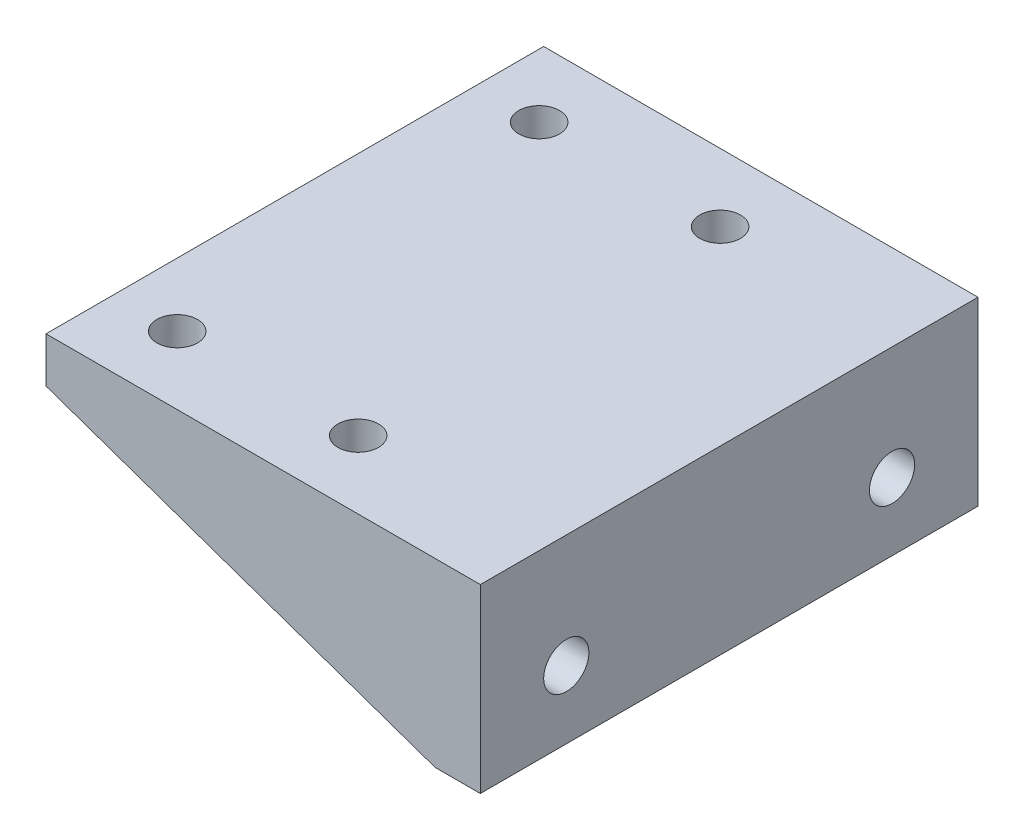
ISO-10303-21;
HEADER;
FILE_DESCRIPTION(('STEP AP214'),'2;1');
FILE_NAME('part.step','',(''),(''),'','','');
FILE_SCHEMA(('AUTOMOTIVE_DESIGN { 1 0 10303 214 1 1 1 1 }'));
ENDSEC;
DATA;
#1=APPLICATION_CONTEXT('core data for automotive mechanical design processes');
#2=APPLICATION_PROTOCOL_DEFINITION('international standard','automotive_design',2000,#1);
#3=PRODUCT_CONTEXT('',#1,'mechanical');
#4=PRODUCT('Part','Part','',(#3));
#5=PRODUCT_RELATED_PRODUCT_CATEGORY('part','',(#4));
#6=PRODUCT_DEFINITION_FORMATION('','',#4);
#7=PRODUCT_DEFINITION_CONTEXT('part definition',#1,'design');
#8=PRODUCT_DEFINITION('design','',#6,#7);
#9=PRODUCT_DEFINITION_SHAPE('','',#8);
#10=(LENGTH_UNIT() NAMED_UNIT(*) SI_UNIT(.MILLI.,.METRE.));
#11=(NAMED_UNIT(*) PLANE_ANGLE_UNIT() SI_UNIT($,.RADIAN.));
#12=(NAMED_UNIT(*) SI_UNIT($,.STERADIAN.) SOLID_ANGLE_UNIT());
#13=UNCERTAINTY_MEASURE_WITH_UNIT(LENGTH_MEASURE(1.E-05),#10,'distance_accuracy_value','');
#14=(GEOMETRIC_REPRESENTATION_CONTEXT(3) GLOBAL_UNCERTAINTY_ASSIGNED_CONTEXT((#13)) GLOBAL_UNIT_ASSIGNED_CONTEXT((#10,
#11,#12)) REPRESENTATION_CONTEXT('',''));
#15=CARTESIAN_POINT('',(0.,0.,0.));
#16=DIRECTION('',(0.,0.,1.));
#17=DIRECTION('',(1.,0.,0.));
#18=AXIS2_PLACEMENT_3D('',#15,#16,#17);
#19=CARTESIAN_POINT('',(0.,0.,0.));
#20=DIRECTION('',(0.,1.,0.));
#21=DIRECTION('',(0.,0.,1.));
#22=AXIS2_PLACEMENT_3D('',#19,#20,#21);
#23=PLANE('',#22);
#24=CARTESIAN_POINT('',(-8.,0.,-20.));
#25=DIRECTION('',(0.,-1.,0.));
#26=DIRECTION('',(0.,0.,-1.));
#27=AXIS2_PLACEMENT_3D('',#24,#25,#26);
#28=CIRCLE('',#27,2.25);
#29=CARTESIAN_POINT('',(-8.,0.,-22.25));
#30=VERTEX_POINT('',#29);
#31=EDGE_CURVE('E385',#30,#30,#28,.T.);
#32=ORIENTED_EDGE('',*,*,#31,.F.);
#33=EDGE_LOOP('',(#32));
#34=FACE_BOUND('',#33,.T.);
#35=CARTESIAN_POINT('',(12.,0.,20.));
#36=DIRECTION('',(0.,-1.,0.));
#37=DIRECTION('',(0.,0.,-1.));
#38=AXIS2_PLACEMENT_3D('',#35,#36,#37);
#39=CIRCLE('',#38,2.25);
#40=CARTESIAN_POINT('',(12.,0.,17.75));
#41=VERTEX_POINT('',#40);
#42=EDGE_CURVE('E386',#41,#41,#39,.T.);
#43=ORIENTED_EDGE('',*,*,#42,.F.);
#44=EDGE_LOOP('',(#43));
#45=FACE_BOUND('',#44,.T.);
#46=CARTESIAN_POINT('',(12.,0.,-20.));
#47=DIRECTION('',(0.,-1.,0.));
#48=DIRECTION('',(0.,0.,-1.));
#49=AXIS2_PLACEMENT_3D('',#46,#47,#48);
#50=CIRCLE('',#49,2.25);
#51=CARTESIAN_POINT('',(12.,0.,-22.25));
#52=VERTEX_POINT('',#51);
#53=EDGE_CURVE('E391',#52,#52,#50,.T.);
#54=ORIENTED_EDGE('',*,*,#53,.F.);
#55=EDGE_LOOP('',(#54));
#56=FACE_BOUND('',#55,.T.);
#57=CARTESIAN_POINT('',(-8.,0.,20.));
#58=DIRECTION('',(0.,-1.,0.));
#59=DIRECTION('',(0.,0.,-1.));
#60=AXIS2_PLACEMENT_3D('',#57,#58,#59);
#61=CIRCLE('',#60,2.25);
#62=CARTESIAN_POINT('',(-8.,0.,17.75));
#63=VERTEX_POINT('',#62);
#64=EDGE_CURVE('E173',#63,#63,#61,.T.);
#65=ORIENTED_EDGE('',*,*,#64,.F.);
#66=EDGE_LOOP('',(#65));
#67=FACE_BOUND('',#66,.T.);
#68=DIRECTION('',(-1.,0.,0.));
#69=VECTOR('',#68,1.);
#70=CARTESIAN_POINT('',(-15.,0.,-24.5));
#71=LINE('',#70,#69);
#72=CARTESIAN_POINT('',(28.,0.,-24.5));
#73=VERTEX_POINT('',#72);
#74=CARTESIAN_POINT('',(-15.,0.,-24.5));
#75=VERTEX_POINT('',#74);
#76=EDGE_CURVE('E106',#73,#75,#71,.T.);
#77=ORIENTED_EDGE('',*,*,#76,.F.);
#78=DIRECTION('',(0.,0.,1.));
#79=VECTOR('',#78,1.);
#80=CARTESIAN_POINT('',(28.,0.,0.));
#81=LINE('',#80,#79);
#82=CARTESIAN_POINT('',(28.,0.,24.5));
#83=VERTEX_POINT('',#82);
#84=EDGE_CURVE('E11',#73,#83,#81,.T.);
#85=ORIENTED_EDGE('',*,*,#84,.T.);
#86=DIRECTION('',(-1.,0.,0.));
#87=VECTOR('',#86,1.);
#88=CARTESIAN_POINT('',(-15.,0.,24.5));
#89=LINE('',#88,#87);
#90=CARTESIAN_POINT('',(-15.,0.,24.5));
#91=VERTEX_POINT('',#90);
#92=EDGE_CURVE('E187',#83,#91,#89,.T.);
#93=ORIENTED_EDGE('',*,*,#92,.T.);
#94=DIRECTION('',(0.,0.,1.));
#95=VECTOR('',#94,1.);
#96=CARTESIAN_POINT('',(-15.,0.,27.5));
#97=LINE('',#96,#95);
#98=EDGE_CURVE('E155',#75,#91,#97,.T.);
#99=ORIENTED_EDGE('',*,*,#98,.F.);
#100=EDGE_LOOP('',(#77,#85,#93,#99));
#101=FACE_BOUND('',#100,.T.);
#102=ADVANCED_FACE('F33',(#34,#45,#56,#67,#101),#23,.F.);
#103=CARTESIAN_POINT('',(28.,0.,0.));
#104=DIRECTION('',(-1.,0.,0.));
#105=DIRECTION('',(0.,0.,1.));
#106=AXIS2_PLACEMENT_3D('',#103,#104,#105);
#107=PLANE('',#106);
#108=CARTESIAN_POINT('',(28.,-7.5,-18.));
#109=DIRECTION('',(1.,0.,0.));
#110=DIRECTION('',(0.,0.,-1.));
#111=AXIS2_PLACEMENT_3D('',#108,#109,#110);
#112=CIRCLE('',#111,2.5);
#113=CARTESIAN_POINT('',(28.,-7.5,-20.5));
#114=VERTEX_POINT('',#113);
#115=EDGE_CURVE('E137',#114,#114,#112,.T.);
#116=ORIENTED_EDGE('',*,*,#115,.T.);
#117=EDGE_LOOP('',(#116));
#118=FACE_BOUND('',#117,.T.);
#119=CARTESIAN_POINT('',(28.,-7.5,18.));
#120=DIRECTION('',(1.,0.,0.));
#121=DIRECTION('',(0.,0.,1.));
#122=AXIS2_PLACEMENT_3D('',#119,#120,#121);
#123=CIRCLE('',#122,2.5);
#124=CARTESIAN_POINT('',(28.,-7.5,20.5));
#125=VERTEX_POINT('',#124);
#126=EDGE_CURVE('E200',#125,#125,#123,.T.);
#127=ORIENTED_EDGE('',*,*,#126,.T.);
#128=EDGE_LOOP('',(#127));
#129=FACE_BOUND('',#128,.T.);
#130=ORIENTED_EDGE('',*,*,#84,.F.);
#131=DIRECTION('',(0.,1.,0.));
#132=VECTOR('',#131,1.);
#133=CARTESIAN_POINT('',(28.,0.,-24.5));
#134=LINE('',#133,#132);
#135=CARTESIAN_POINT('',(28.,-15.,-24.5));
#136=VERTEX_POINT('',#135);
#137=EDGE_CURVE('E104',#136,#73,#134,.T.);
#138=ORIENTED_EDGE('',*,*,#137,.F.);
#139=DIRECTION('',(0.,0.,-1.));
#140=VECTOR('',#139,1.);
#141=CARTESIAN_POINT('',(28.,-15.,-27.5));
#142=LINE('',#141,#140);
#143=CARTESIAN_POINT('',(28.,-15.,24.5));
#144=VERTEX_POINT('',#143);
#145=EDGE_CURVE('E126',#144,#136,#142,.T.);
#146=ORIENTED_EDGE('',*,*,#145,.F.);
#147=DIRECTION('',(0.,1.,0.));
#148=VECTOR('',#147,1.);
#149=CARTESIAN_POINT('',(28.,0.,24.5));
#150=LINE('',#149,#148);
#151=EDGE_CURVE('E185',#144,#83,#150,.T.);
#152=ORIENTED_EDGE('',*,*,#151,.T.);
#153=EDGE_LOOP('',(#130,#138,#146,#152));
#154=FACE_BOUND('',#153,.T.);
#155=ADVANCED_FACE('F124',(#118,#129,#154),#107,.T.);
#156=CARTESIAN_POINT('',(-15.,5.,27.5));
#157=DIRECTION('',(1.,0.,0.));
#158=DIRECTION('',(0.,0.,-1.));
#159=AXIS2_PLACEMENT_3D('',#156,#157,#158);
#160=PLANE('',#159);
#161=CARTESIAN_POINT('',(-15.,0.,-27.5));
#162=VERTEX_POINT('',#161);
#163=EDGE_CURVE('E159',#162,#75,#97,.T.);
#164=ORIENTED_EDGE('',*,*,#163,.T.);
#165=ORIENTED_EDGE('',*,*,#98,.T.);
#166=DIRECTION('',(0.,0.,1.));
#167=VECTOR('',#166,1.);
#168=CARTESIAN_POINT('',(-15.,0.,24.5));
#169=LINE('',#168,#167);
#170=CARTESIAN_POINT('',(-15.,0.,27.5));
#171=VERTEX_POINT('',#170);
#172=EDGE_CURVE('E191',#91,#171,#169,.T.);
#173=ORIENTED_EDGE('',*,*,#172,.T.);
#174=DIRECTION('',(0.,-1.,0.));
#175=VECTOR('',#174,1.);
#176=CARTESIAN_POINT('',(-15.,5.,27.5));
#177=LINE('',#176,#175);
#178=CARTESIAN_POINT('',(-15.,5.,27.5));
#179=VERTEX_POINT('',#178);
#180=EDGE_CURVE('E42',#179,#171,#177,.T.);
#181=ORIENTED_EDGE('',*,*,#180,.F.);
#182=DIRECTION('',(0.,0.,1.));
#183=VECTOR('',#182,1.);
#184=CARTESIAN_POINT('',(-15.,5.,27.5));
#185=LINE('',#184,#183);
#186=CARTESIAN_POINT('',(-15.,5.,-27.5));
#187=VERTEX_POINT('',#186);
#188=EDGE_CURVE('E156',#187,#179,#185,.T.);
#189=ORIENTED_EDGE('',*,*,#188,.F.);
#190=DIRECTION('',(0.,-1.,0.));
#191=VECTOR('',#190,1.);
#192=CARTESIAN_POINT('',(-15.,5.,-27.5));
#193=LINE('',#192,#191);
#194=EDGE_CURVE('E162',#187,#162,#193,.T.);
#195=ORIENTED_EDGE('',*,*,#194,.T.);
#196=EDGE_LOOP('',(#164,#165,#173,#181,#189,#195));
#197=FACE_BOUND('',#196,.T.);
#198=ADVANCED_FACE('F35',(#197),#160,.F.);
#199=CARTESIAN_POINT('',(15.,5.,27.5));
#200=DIRECTION('',(0.,0.,-1.));
#201=DIRECTION('',(-1.,0.,0.));
#202=AXIS2_PLACEMENT_3D('',#199,#200,#201);
#203=PLANE('',#202);
#204=ORIENTED_EDGE('',*,*,#180,.T.);
#205=DIRECTION('',(0.944200181445776,-0.329372156318294,0.));
#206=VECTOR('',#205,1.);
#207=CARTESIAN_POINT('',(28.,-15.,27.5));
#208=LINE('',#207,#206);
#209=CARTESIAN_POINT('',(28.,-15.,27.5));
#210=VERTEX_POINT('',#209);
#211=EDGE_CURVE('E119',#171,#210,#208,.T.);
#212=ORIENTED_EDGE('',*,*,#211,.T.);
#213=DIRECTION('',(1.,0.,0.));
#214=VECTOR('',#213,1.);
#215=CARTESIAN_POINT('',(28.,-15.,27.5));
#216=LINE('',#215,#214);
#217=CARTESIAN_POINT('',(33.,-15.,27.5));
#218=VERTEX_POINT('',#217);
#219=EDGE_CURVE('E135',#210,#218,#216,.T.);
#220=ORIENTED_EDGE('',*,*,#219,.T.);
#221=DIRECTION('',(0.,-1.,0.));
#222=VECTOR('',#221,1.);
#223=CARTESIAN_POINT('',(33.,5.,27.5));
#224=LINE('',#223,#222);
#225=CARTESIAN_POINT('',(33.,5.,27.5));
#226=VERTEX_POINT('',#225);
#227=EDGE_CURVE('E145',#226,#218,#224,.T.);
#228=ORIENTED_EDGE('',*,*,#227,.F.);
#229=DIRECTION('',(1.,0.,0.));
#230=VECTOR('',#229,1.);
#231=CARTESIAN_POINT('',(15.,5.,27.5));
#232=LINE('',#231,#230);
#233=EDGE_CURVE('E158',#179,#226,#232,.T.);
#234=ORIENTED_EDGE('',*,*,#233,.F.);
#235=EDGE_LOOP('',(#204,#212,#220,#228,#234));
#236=FACE_BOUND('',#235,.T.);
#237=ADVANCED_FACE('F217',(#236),#203,.F.);
#238=CARTESIAN_POINT('',(15.,5.,-27.5));
#239=DIRECTION('',(0.,0.,1.));
#240=DIRECTION('',(1.,0.,0.));
#241=AXIS2_PLACEMENT_3D('',#238,#239,#240);
#242=PLANE('',#241);
#243=ORIENTED_EDGE('',*,*,#194,.F.);
#244=DIRECTION('',(-1.,0.,0.));
#245=VECTOR('',#244,1.);
#246=CARTESIAN_POINT('',(15.,5.,-27.5));
#247=LINE('',#246,#245);
#248=CARTESIAN_POINT('',(33.,5.,-27.5));
#249=VERTEX_POINT('',#248);
#250=EDGE_CURVE('E58',#249,#187,#247,.T.);
#251=ORIENTED_EDGE('',*,*,#250,.F.);
#252=DIRECTION('',(0.,1.,0.));
#253=VECTOR('',#252,1.);
#254=CARTESIAN_POINT('',(33.,5.,-27.5));
#255=LINE('',#254,#253);
#256=CARTESIAN_POINT('',(33.,-15.,-27.5));
#257=VERTEX_POINT('',#256);
#258=EDGE_CURVE('E149',#257,#249,#255,.T.);
#259=ORIENTED_EDGE('',*,*,#258,.F.);
#260=DIRECTION('',(1.,0.,0.));
#261=VECTOR('',#260,1.);
#262=CARTESIAN_POINT('',(28.,-15.,-27.5));
#263=LINE('',#262,#261);
#264=CARTESIAN_POINT('',(28.,-15.,-27.5));
#265=VERTEX_POINT('',#264);
#266=EDGE_CURVE('E143',#265,#257,#263,.T.);
#267=ORIENTED_EDGE('',*,*,#266,.F.);
#268=DIRECTION('',(0.944200181445776,-0.329372156318294,0.));
#269=VECTOR('',#268,1.);
#270=CARTESIAN_POINT('',(28.,-15.,-27.5));
#271=LINE('',#270,#269);
#272=EDGE_CURVE('E114',#162,#265,#271,.T.);
#273=ORIENTED_EDGE('',*,*,#272,.F.);
#274=EDGE_LOOP('',(#243,#251,#259,#267,#273));
#275=FACE_BOUND('',#274,.T.);
#276=ADVANCED_FACE('F219',(#275),#242,.F.);
#277=CARTESIAN_POINT('',(0.,5.,0.));
#278=DIRECTION('',(0.,1.,0.));
#279=DIRECTION('',(0.,0.,1.));
#280=AXIS2_PLACEMENT_3D('',#277,#278,#279);
#281=PLANE('',#280);
#282=CARTESIAN_POINT('',(-8.,5.,-20.));
#283=DIRECTION('',(0.,1.,0.));
#284=DIRECTION('',(0.,0.,1.));
#285=AXIS2_PLACEMENT_3D('',#282,#283,#284);
#286=CIRCLE('',#285,2.25);
#287=CARTESIAN_POINT('',(-8.,5.,-17.75));
#288=VERTEX_POINT('',#287);
#289=EDGE_CURVE('E37',#288,#288,#286,.T.);
#290=ORIENTED_EDGE('',*,*,#289,.F.);
#291=EDGE_LOOP('',(#290));
#292=FACE_BOUND('',#291,.T.);
#293=CARTESIAN_POINT('',(12.,5.,20.));
#294=DIRECTION('',(0.,1.,0.));
#295=DIRECTION('',(0.,0.,1.));
#296=AXIS2_PLACEMENT_3D('',#293,#294,#295);
#297=CIRCLE('',#296,2.25);
#298=CARTESIAN_POINT('',(12.,5.,22.25));
#299=VERTEX_POINT('',#298);
#300=EDGE_CURVE('E175',#299,#299,#297,.T.);
#301=ORIENTED_EDGE('',*,*,#300,.F.);
#302=EDGE_LOOP('',(#301));
#303=FACE_BOUND('',#302,.T.);
#304=CARTESIAN_POINT('',(12.,5.,-20.));
#305=DIRECTION('',(0.,1.,0.));
#306=DIRECTION('',(0.,0.,1.));
#307=AXIS2_PLACEMENT_3D('',#304,#305,#306);
#308=CIRCLE('',#307,2.25);
#309=CARTESIAN_POINT('',(12.,5.,-17.75));
#310=VERTEX_POINT('',#309);
#311=EDGE_CURVE('E172',#310,#310,#308,.T.);
#312=ORIENTED_EDGE('',*,*,#311,.F.);
#313=EDGE_LOOP('',(#312));
#314=FACE_BOUND('',#313,.T.);
#315=CARTESIAN_POINT('',(-8.,5.,20.));
#316=DIRECTION('',(0.,1.,0.));
#317=DIRECTION('',(0.,0.,1.));
#318=AXIS2_PLACEMENT_3D('',#315,#316,#317);
#319=CIRCLE('',#318,2.25);
#320=CARTESIAN_POINT('',(-8.,5.,22.25));
#321=VERTEX_POINT('',#320);
#322=EDGE_CURVE('E169',#321,#321,#319,.T.);
#323=ORIENTED_EDGE('',*,*,#322,.F.);
#324=EDGE_LOOP('',(#323));
#325=FACE_BOUND('',#324,.T.);
#326=ORIENTED_EDGE('',*,*,#233,.T.);
#327=DIRECTION('',(0.,0.,1.));
#328=VECTOR('',#327,1.);
#329=CARTESIAN_POINT('',(33.,5.,27.5));
#330=LINE('',#329,#328);
#331=EDGE_CURVE('E152',#249,#226,#330,.T.);
#332=ORIENTED_EDGE('',*,*,#331,.F.);
#333=ORIENTED_EDGE('',*,*,#250,.T.);
#334=ORIENTED_EDGE('',*,*,#188,.T.);
#335=EDGE_LOOP('',(#326,#332,#333,#334));
#336=FACE_BOUND('',#335,.T.);
#337=ADVANCED_FACE('F212',(#292,#303,#314,#325,#336),#281,.T.);
#338=CARTESIAN_POINT('',(33.,0.,0.));
#339=DIRECTION('',(1.,0.,0.));
#340=DIRECTION('',(0.,0.,-1.));
#341=AXIS2_PLACEMENT_3D('',#338,#339,#340);
#342=PLANE('',#341);
#343=CARTESIAN_POINT('',(33.,-7.5,-18.));
#344=DIRECTION('',(1.,0.,0.));
#345=DIRECTION('',(0.,0.,-1.));
#346=AXIS2_PLACEMENT_3D('',#343,#344,#345);
#347=CIRCLE('',#346,2.5);
#348=CARTESIAN_POINT('',(33.,-7.5,-20.5));
#349=VERTEX_POINT('',#348);
#350=EDGE_CURVE('E198',#349,#349,#347,.T.);
#351=ORIENTED_EDGE('',*,*,#350,.F.);
#352=EDGE_LOOP('',(#351));
#353=FACE_BOUND('',#352,.T.);
#354=CARTESIAN_POINT('',(33.,-7.5,18.));
#355=DIRECTION('',(1.,0.,0.));
#356=DIRECTION('',(0.,0.,1.));
#357=AXIS2_PLACEMENT_3D('',#354,#355,#356);
#358=CIRCLE('',#357,2.5);
#359=CARTESIAN_POINT('',(33.,-7.5,20.5));
#360=VERTEX_POINT('',#359);
#361=EDGE_CURVE('E140',#360,#360,#358,.T.);
#362=ORIENTED_EDGE('',*,*,#361,.F.);
#363=EDGE_LOOP('',(#362));
#364=FACE_BOUND('',#363,.T.);
#365=ORIENTED_EDGE('',*,*,#227,.T.);
#366=DIRECTION('',(0.,0.,-1.));
#367=VECTOR('',#366,1.);
#368=CARTESIAN_POINT('',(33.,-15.,-27.5));
#369=LINE('',#368,#367);
#370=EDGE_CURVE('E133',#218,#257,#369,.T.);
#371=ORIENTED_EDGE('',*,*,#370,.T.);
#372=ORIENTED_EDGE('',*,*,#258,.T.);
#373=ORIENTED_EDGE('',*,*,#331,.T.);
#374=EDGE_LOOP('',(#365,#371,#372,#373));
#375=FACE_BOUND('',#374,.T.);
#376=ADVANCED_FACE('F209',(#353,#364,#375),#342,.T.);
#377=CARTESIAN_POINT('',(28.,-15.,-27.5));
#378=DIRECTION('',(0.,-1.,0.));
#379=DIRECTION('',(0.,0.,-1.));
#380=AXIS2_PLACEMENT_3D('',#377,#378,#379);
#381=PLANE('',#380);
#382=ORIENTED_EDGE('',*,*,#370,.F.);
#383=ORIENTED_EDGE('',*,*,#219,.F.);
#384=EDGE_CURVE('E132',#210,#144,#142,.T.);
#385=ORIENTED_EDGE('',*,*,#384,.T.);
#386=ORIENTED_EDGE('',*,*,#145,.T.);
#387=DIRECTION('',(0.,0.,-1.));
#388=VECTOR('',#387,1.);
#389=CARTESIAN_POINT('',(28.,-15.,-24.5));
#390=LINE('',#389,#388);
#391=EDGE_CURVE('E111',#136,#265,#390,.T.);
#392=ORIENTED_EDGE('',*,*,#391,.T.);
#393=ORIENTED_EDGE('',*,*,#266,.T.);
#394=EDGE_LOOP('',(#382,#383,#385,#386,#392,#393));
#395=FACE_BOUND('',#394,.T.);
#396=ADVANCED_FACE('F130',(#395),#381,.T.);
#397=CARTESIAN_POINT('',(28.,-7.5,18.));
#398=DIRECTION('',(1.,0.,0.));
#399=DIRECTION('',(0.,0.,-1.));
#400=AXIS2_PLACEMENT_3D('',#397,#398,#399);
#401=CYLINDRICAL_SURFACE('',#400,2.5);
#402=ORIENTED_EDGE('',*,*,#126,.F.);
#403=EDGE_LOOP('',(#402));
#404=FACE_BOUND('',#403,.T.);
#405=ORIENTED_EDGE('',*,*,#361,.T.);
#406=EDGE_LOOP('',(#405));
#407=FACE_BOUND('',#406,.T.);
#408=ADVANCED_FACE('F207',(#404,#407),#401,.F.);
#409=CARTESIAN_POINT('',(28.,-7.5,-18.));
#410=DIRECTION('',(1.,0.,0.));
#411=DIRECTION('',(0.,0.,-1.));
#412=AXIS2_PLACEMENT_3D('',#409,#410,#411);
#413=CYLINDRICAL_SURFACE('',#412,2.5);
#414=ORIENTED_EDGE('',*,*,#115,.F.);
#415=EDGE_LOOP('',(#414));
#416=FACE_BOUND('',#415,.T.);
#417=ORIENTED_EDGE('',*,*,#350,.T.);
#418=EDGE_LOOP('',(#417));
#419=FACE_BOUND('',#418,.T.);
#420=ADVANCED_FACE('F270',(#416,#419),#413,.F.);
#421=CARTESIAN_POINT('',(28.,-15.,24.5));
#422=DIRECTION('',(-0.329372156318294,-0.944200181445776,0.));
#423=DIRECTION('',(0.944200181445776,-0.329372156318294,0.));
#424=AXIS2_PLACEMENT_3D('',#421,#422,#423);
#425=PLANE('',#424);
#426=ORIENTED_EDGE('',*,*,#211,.F.);
#427=ORIENTED_EDGE('',*,*,#172,.F.);
#428=DIRECTION('',(0.944200181445776,-0.329372156318294,0.));
#429=VECTOR('',#428,1.);
#430=CARTESIAN_POINT('',(28.,-15.,24.5));
#431=LINE('',#430,#429);
#432=EDGE_CURVE('E50',#91,#144,#431,.T.);
#433=ORIENTED_EDGE('',*,*,#432,.T.);
#434=ORIENTED_EDGE('',*,*,#384,.F.);
#435=EDGE_LOOP('',(#426,#427,#433,#434));
#436=FACE_BOUND('',#435,.T.);
#437=ADVANCED_FACE('F223',(#436),#425,.T.);
#438=CARTESIAN_POINT('',(0.,0.,24.5));
#439=DIRECTION('',(0.,0.,1.));
#440=DIRECTION('',(1.,0.,0.));
#441=AXIS2_PLACEMENT_3D('',#438,#439,#440);
#442=PLANE('',#441);
#443=ORIENTED_EDGE('',*,*,#151,.F.);
#444=ORIENTED_EDGE('',*,*,#432,.F.);
#445=ORIENTED_EDGE('',*,*,#92,.F.);
#446=EDGE_LOOP('',(#443,#444,#445));
#447=FACE_BOUND('',#446,.T.);
#448=ADVANCED_FACE('F226',(#447),#442,.F.);
#449=CARTESIAN_POINT('',(28.,-15.,-24.5));
#450=DIRECTION('',(0.329372156318294,0.944200181445776,0.));
#451=DIRECTION('',(-0.944200181445776,0.329372156318294,0.));
#452=AXIS2_PLACEMENT_3D('',#449,#450,#451);
#453=PLANE('',#452);
#454=ORIENTED_EDGE('',*,*,#272,.T.);
#455=ORIENTED_EDGE('',*,*,#391,.F.);
#456=DIRECTION('',(0.944200181445776,-0.329372156318294,0.));
#457=VECTOR('',#456,1.);
#458=CARTESIAN_POINT('',(28.,-15.,-24.5));
#459=LINE('',#458,#457);
#460=EDGE_CURVE('E100',#75,#136,#459,.T.);
#461=ORIENTED_EDGE('',*,*,#460,.F.);
#462=ORIENTED_EDGE('',*,*,#163,.F.);
#463=EDGE_LOOP('',(#454,#455,#461,#462));
#464=FACE_BOUND('',#463,.T.);
#465=ADVANCED_FACE('F112',(#464),#453,.F.);
#466=CARTESIAN_POINT('',(0.,0.,-24.5));
#467=DIRECTION('',(0.,0.,-1.));
#468=DIRECTION('',(1.,0.,0.));
#469=AXIS2_PLACEMENT_3D('',#466,#467,#468);
#470=PLANE('',#469);
#471=ORIENTED_EDGE('',*,*,#137,.T.);
#472=ORIENTED_EDGE('',*,*,#76,.T.);
#473=ORIENTED_EDGE('',*,*,#460,.T.);
#474=EDGE_LOOP('',(#471,#472,#473));
#475=FACE_BOUND('',#474,.T.);
#476=ADVANCED_FACE('F102',(#475),#470,.F.);
#477=CARTESIAN_POINT('',(-8.,10.,20.));
#478=DIRECTION('',(0.,-1.,0.));
#479=DIRECTION('',(0.,0.,-1.));
#480=AXIS2_PLACEMENT_3D('',#477,#478,#479);
#481=CYLINDRICAL_SURFACE('',#480,2.25);
#482=ORIENTED_EDGE('',*,*,#322,.T.);
#483=EDGE_LOOP('',(#482));
#484=FACE_BOUND('',#483,.T.);
#485=ORIENTED_EDGE('',*,*,#64,.T.);
#486=EDGE_LOOP('',(#485));
#487=FACE_BOUND('',#486,.T.);
#488=ADVANCED_FACE('F330',(#484,#487),#481,.F.);
#489=CARTESIAN_POINT('',(12.,10.,-20.));
#490=DIRECTION('',(0.,-1.,0.));
#491=DIRECTION('',(0.,0.,-1.));
#492=AXIS2_PLACEMENT_3D('',#489,#490,#491);
#493=CYLINDRICAL_SURFACE('',#492,2.25);
#494=ORIENTED_EDGE('',*,*,#311,.T.);
#495=EDGE_LOOP('',(#494));
#496=FACE_BOUND('',#495,.T.);
#497=ORIENTED_EDGE('',*,*,#53,.T.);
#498=EDGE_LOOP('',(#497));
#499=FACE_BOUND('',#498,.T.);
#500=ADVANCED_FACE('F351',(#496,#499),#493,.F.);
#501=CARTESIAN_POINT('',(12.,10.,20.));
#502=DIRECTION('',(0.,-1.,0.));
#503=DIRECTION('',(0.,0.,-1.));
#504=AXIS2_PLACEMENT_3D('',#501,#502,#503);
#505=CYLINDRICAL_SURFACE('',#504,2.25);
#506=ORIENTED_EDGE('',*,*,#300,.T.);
#507=EDGE_LOOP('',(#506));
#508=FACE_BOUND('',#507,.T.);
#509=ORIENTED_EDGE('',*,*,#42,.T.);
#510=EDGE_LOOP('',(#509));
#511=FACE_BOUND('',#510,.T.);
#512=ADVANCED_FACE('F361',(#508,#511),#505,.F.);
#513=CARTESIAN_POINT('',(-8.,10.,-20.));
#514=DIRECTION('',(0.,-1.,0.));
#515=DIRECTION('',(0.,0.,-1.));
#516=AXIS2_PLACEMENT_3D('',#513,#514,#515);
#517=CYLINDRICAL_SURFACE('',#516,2.25);
#518=ORIENTED_EDGE('',*,*,#289,.T.);
#519=EDGE_LOOP('',(#518));
#520=FACE_BOUND('',#519,.T.);
#521=ORIENTED_EDGE('',*,*,#31,.T.);
#522=EDGE_LOOP('',(#521));
#523=FACE_BOUND('',#522,.T.);
#524=ADVANCED_FACE('F371',(#520,#523),#517,.F.);
#525=CLOSED_SHELL('',(#102,#155,#198,#237,#276,#337,#376,#396,#408,#420,#437,#448,#465,#476,
#488,#500,#512,#524));
#526=MANIFOLD_SOLID_BREP('B2',#525);
#527=ADVANCED_BREP_SHAPE_REPRESENTATION('',(#18,#526),#14);
#528=SHAPE_DEFINITION_REPRESENTATION(#9,#527);
ENDSEC;
END-ISO-10303-21;
